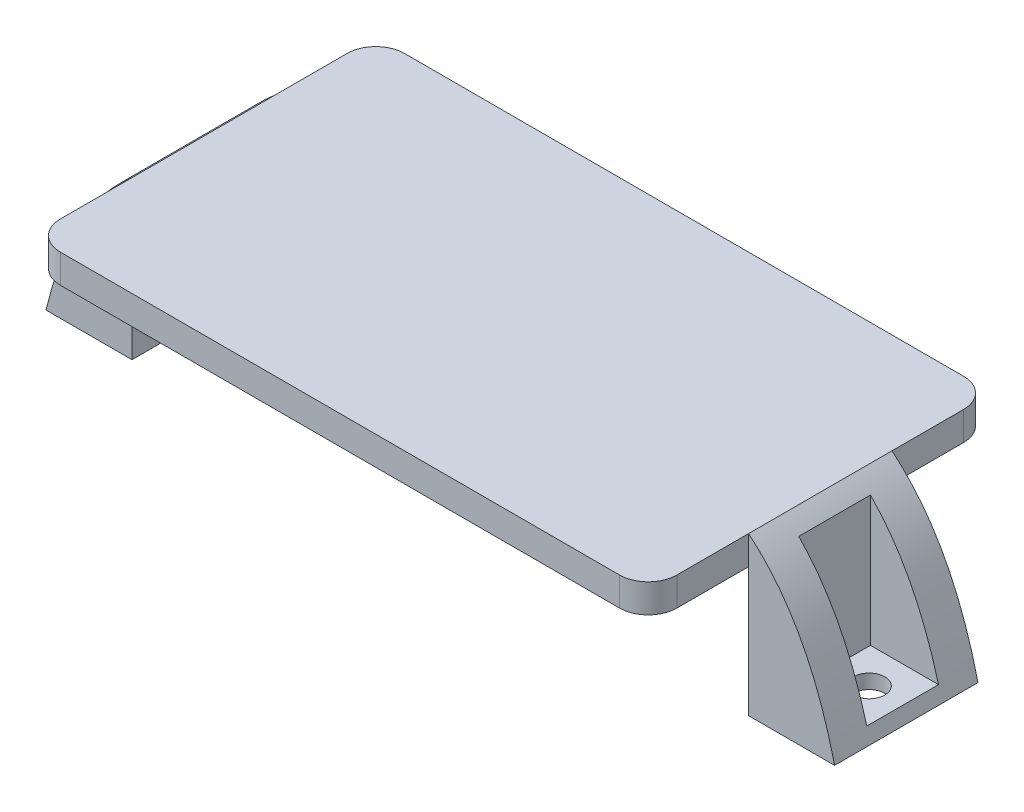
ISO-10303-21;
HEADER;
FILE_DESCRIPTION(('STEP AP214'),'2;1');
FILE_NAME('part.step','',(''),(''),'','','');
FILE_SCHEMA(('AUTOMOTIVE_DESIGN { 1 0 10303 214 1 1 1 1 }'));
ENDSEC;
DATA;
#1=APPLICATION_CONTEXT('core data for automotive mechanical design processes');
#2=APPLICATION_PROTOCOL_DEFINITION('international standard','automotive_design',2000,#1);
#3=PRODUCT_CONTEXT('',#1,'mechanical');
#4=PRODUCT('Part','Part','',(#3));
#5=PRODUCT_RELATED_PRODUCT_CATEGORY('part','',(#4));
#6=PRODUCT_DEFINITION_FORMATION('','',#4);
#7=PRODUCT_DEFINITION_CONTEXT('part definition',#1,'design');
#8=PRODUCT_DEFINITION('design','',#6,#7);
#9=PRODUCT_DEFINITION_SHAPE('','',#8);
#10=(LENGTH_UNIT() NAMED_UNIT(*) SI_UNIT(.MILLI.,.METRE.));
#11=(NAMED_UNIT(*) PLANE_ANGLE_UNIT() SI_UNIT($,.RADIAN.));
#12=(NAMED_UNIT(*) SI_UNIT($,.STERADIAN.) SOLID_ANGLE_UNIT());
#13=UNCERTAINTY_MEASURE_WITH_UNIT(LENGTH_MEASURE(1.E-05),#10,'distance_accuracy_value','');
#14=(GEOMETRIC_REPRESENTATION_CONTEXT(3) GLOBAL_UNCERTAINTY_ASSIGNED_CONTEXT((#13)) GLOBAL_UNIT_ASSIGNED_CONTEXT((#10,
#11,#12)) REPRESENTATION_CONTEXT('',''));
#15=CARTESIAN_POINT('',(0.,0.,0.));
#16=DIRECTION('',(0.,0.,1.));
#17=DIRECTION('',(1.,0.,0.));
#18=AXIS2_PLACEMENT_3D('',#15,#16,#17);
#19=CARTESIAN_POINT('',(-34.925,-13.97,-6.35));
#20=CARTESIAN_POINT('',(-28.7239984805834,11.9854693092136,-6.35));
#21=CARTESIAN_POINT('',(0.,0.,-6.35));
#22=B_SPLINE_CURVE_WITH_KNOTS('',2,(#19,#20,#21),.UNSPECIFIED.,.F.,.F.,(3,3),(0.,1.),.UNSPECIFIED.);
#23=DIRECTION('',(0.,0.,1.));
#24=VECTOR('',#23,1.);
#25=SURFACE_OF_LINEAR_EXTRUSION('',#22,#24);
#26=DIRECTION('',(0.,0.,1.));
#27=VECTOR('',#26,1.);
#28=CARTESIAN_POINT('',(-34.925,-13.97,-6.35));
#29=LINE('',#28,#27);
#30=CARTESIAN_POINT('',(-34.925,-13.97,-6.35));
#31=VERTEX_POINT('',#30);
#32=CARTESIAN_POINT('',(-34.925,-13.97,6.35));
#33=VERTEX_POINT('',#32);
#34=EDGE_CURVE('E243',#31,#33,#29,.T.);
#35=ORIENTED_EDGE('',*,*,#34,.T.);
#36=CARTESIAN_POINT('',(-34.925,-13.97,6.35));
#37=CARTESIAN_POINT('',(-28.7239984805834,11.9854693092136,6.35));
#38=CARTESIAN_POINT('',(0.,0.,6.35));
#39=B_SPLINE_CURVE_WITH_KNOTS('',2,(#36,#37,#38),.UNSPECIFIED.,.F.,.F.,(3,3),(0.,1.),.UNSPECIFIED.);
#40=CARTESIAN_POINT('',(-27.305,0.,6.35));
#41=VERTEX_POINT('',#40);
#42=EDGE_CURVE('E221',#33,#41,#39,.T.);
#43=ORIENTED_EDGE('',*,*,#42,.T.);
#44=DIRECTION('',(0.,0.,1.));
#45=VECTOR('',#44,1.);
#46=CARTESIAN_POINT('',(-27.305,0.,-6.35));
#47=LINE('',#46,#45);
#48=CARTESIAN_POINT('',(-27.305,0.,-6.34999999999999));
#49=VERTEX_POINT('',#48);
#50=EDGE_CURVE('E467',#49,#41,#47,.T.);
#51=ORIENTED_EDGE('',*,*,#50,.F.);
#52=EDGE_CURVE('E236',#31,#49,#22,.T.);
#53=ORIENTED_EDGE('',*,*,#52,.F.);
#54=EDGE_LOOP('',(#35,#43,#51,#53));
#55=FACE_BOUND('',#54,.T.);
#56=CARTESIAN_POINT('',(-34.925,-13.97,-3.175));
#57=CARTESIAN_POINT('',(-28.7239984805834,11.9854693092136,-3.175));
#58=CARTESIAN_POINT('',(0.,0.,-3.175));
#59=B_SPLINE_CURVE_WITH_KNOTS('',2,(#56,#57,#58),.UNSPECIFIED.,.F.,.F.,(3,3),(0.,1.),.UNSPECIFIED.);
#60=CARTESIAN_POINT('',(-28.575,-1.16685256923188,-3.175));
#61=VERTEX_POINT('',#60);
#62=CARTESIAN_POINT('',(-34.6019711182352,-12.7,-3.175));
#63=VERTEX_POINT('',#62);
#64=EDGE_CURVE('E11',#61,#63,#59,.F.);
#65=ORIENTED_EDGE('',*,*,#64,.F.);
#66=DIRECTION('',(0.,0.,1.));
#67=VECTOR('',#66,1.);
#68=CARTESIAN_POINT('',(-28.575,-1.16685256923188,-6.35));
#69=LINE('',#68,#67);
#70=CARTESIAN_POINT('',(-28.575,-1.16685256923593,3.175));
#71=VERTEX_POINT('',#70);
#72=EDGE_CURVE('E50',#71,#61,#69,.F.);
#73=ORIENTED_EDGE('',*,*,#72,.F.);
#74=CARTESIAN_POINT('',(-34.925,-13.97,3.175));
#75=CARTESIAN_POINT('',(-28.7239984805834,11.9854693092136,3.175));
#76=CARTESIAN_POINT('',(0.,0.,3.175));
#77=B_SPLINE_CURVE_WITH_KNOTS('',2,(#74,#75,#76),.UNSPECIFIED.,.F.,.F.,(3,3),(0.,1.),.UNSPECIFIED.);
#78=CARTESIAN_POINT('',(-34.6019711182352,-12.7,3.175));
#79=VERTEX_POINT('',#78);
#80=EDGE_CURVE('E204',#79,#71,#77,.T.);
#81=ORIENTED_EDGE('',*,*,#80,.F.);
#82=DIRECTION('',(0.,0.,1.));
#83=VECTOR('',#82,1.);
#84=CARTESIAN_POINT('',(-34.6019711182352,-12.7,-6.35));
#85=LINE('',#84,#83);
#86=EDGE_CURVE('E208',#63,#79,#85,.T.);
#87=ORIENTED_EDGE('',*,*,#86,.F.);
#88=EDGE_LOOP('',(#65,#73,#81,#87));
#89=FACE_BOUND('',#88,.T.);
#90=ADVANCED_FACE('F41',(#55,#89),#25,.F.);
#91=CARTESIAN_POINT('',(-27.305,-2.54,15.24));
#92=DIRECTION('',(-1.,0.,0.));
#93=DIRECTION('',(0.,0.,1.));
#94=AXIS2_PLACEMENT_3D('',#91,#92,#93);
#95=PLANE('',#94);
#96=DIRECTION('',(0.,0.,1.));
#97=VECTOR('',#96,1.);
#98=CARTESIAN_POINT('',(-27.305,0.,15.24));
#99=LINE('',#98,#97);
#100=CARTESIAN_POINT('',(-27.305,0.,12.7));
#101=VERTEX_POINT('',#100);
#102=EDGE_CURVE('E348',#41,#101,#99,.T.);
#103=ORIENTED_EDGE('',*,*,#102,.F.);
#104=DIRECTION('',(0.,-1.,0.));
#105=VECTOR('',#104,1.);
#106=CARTESIAN_POINT('',(-27.305,0.,6.35));
#107=LINE('',#106,#105);
#108=CARTESIAN_POINT('',(-27.305,-2.54,6.35));
#109=VERTEX_POINT('',#108);
#110=EDGE_CURVE('E64',#41,#109,#107,.T.);
#111=ORIENTED_EDGE('',*,*,#110,.T.);
#112=DIRECTION('',(0.,0.,1.));
#113=VECTOR('',#112,1.);
#114=CARTESIAN_POINT('',(-27.305,-2.54,15.24));
#115=LINE('',#114,#113);
#116=CARTESIAN_POINT('',(-27.305,-2.54,12.7));
#117=VERTEX_POINT('',#116);
#118=EDGE_CURVE('E334',#109,#117,#115,.T.);
#119=ORIENTED_EDGE('',*,*,#118,.T.);
#120=DIRECTION('',(0.,1.,0.));
#121=VECTOR('',#120,1.);
#122=CARTESIAN_POINT('',(-27.305,-2.54,12.7));
#123=LINE('',#122,#121);
#124=EDGE_CURVE('E367',#117,#101,#123,.T.);
#125=ORIENTED_EDGE('',*,*,#124,.T.);
#126=EDGE_LOOP('',(#103,#111,#119,#125));
#127=FACE_BOUND('',#126,.T.);
#128=ADVANCED_FACE('F252',(#127),#95,.T.);
#129=CARTESIAN_POINT('',(27.305,-2.54,15.24));
#130=DIRECTION('',(1.,0.,0.));
#131=DIRECTION('',(0.,0.,-1.));
#132=AXIS2_PLACEMENT_3D('',#129,#130,#131);
#133=PLANE('',#132);
#134=DIRECTION('',(0.,0.,-1.));
#135=VECTOR('',#134,1.);
#136=CARTESIAN_POINT('',(27.305,0.,15.24));
#137=LINE('',#136,#135);
#138=CARTESIAN_POINT('',(27.305,0.,-6.35));
#139=VERTEX_POINT('',#138);
#140=CARTESIAN_POINT('',(27.305,0.,-12.7));
#141=VERTEX_POINT('',#140);
#142=EDGE_CURVE('E322',#139,#141,#137,.T.);
#143=ORIENTED_EDGE('',*,*,#142,.F.);
#144=DIRECTION('',(0.,-1.,0.));
#145=VECTOR('',#144,1.);
#146=CARTESIAN_POINT('',(27.305,0.,-6.35));
#147=LINE('',#146,#145);
#148=CARTESIAN_POINT('',(27.305,-2.54,-6.34999999999999));
#149=VERTEX_POINT('',#148);
#150=EDGE_CURVE('E312',#139,#149,#147,.T.);
#151=ORIENTED_EDGE('',*,*,#150,.T.);
#152=DIRECTION('',(0.,0.,-1.));
#153=VECTOR('',#152,1.);
#154=CARTESIAN_POINT('',(27.305,-2.54,15.24));
#155=LINE('',#154,#153);
#156=CARTESIAN_POINT('',(27.305,-2.54,-12.7));
#157=VERTEX_POINT('',#156);
#158=EDGE_CURVE('E331',#149,#157,#155,.T.);
#159=ORIENTED_EDGE('',*,*,#158,.T.);
#160=DIRECTION('',(0.,1.,0.));
#161=VECTOR('',#160,1.);
#162=CARTESIAN_POINT('',(27.305,-2.54,-12.7));
#163=LINE('',#162,#161);
#164=EDGE_CURVE('E387',#157,#141,#163,.T.);
#165=ORIENTED_EDGE('',*,*,#164,.T.);
#166=EDGE_LOOP('',(#143,#151,#159,#165));
#167=FACE_BOUND('',#166,.T.);
#168=ADVANCED_FACE('F556',(#167),#133,.T.);
#169=DIRECTION('',(0.,-1.,0.));
#170=VECTOR('',#169,1.);
#171=CARTESIAN_POINT('',(27.305,0.,6.35));
#172=LINE('',#171,#170);
#173=CARTESIAN_POINT('',(27.305,0.,6.35));
#174=VERTEX_POINT('',#173);
#175=CARTESIAN_POINT('',(27.305,-2.54,6.35));
#176=VERTEX_POINT('',#175);
#177=EDGE_CURVE('E496',#174,#176,#172,.T.);
#178=ORIENTED_EDGE('',*,*,#177,.F.);
#179=CARTESIAN_POINT('',(27.305,0.,12.7));
#180=VERTEX_POINT('',#179);
#181=EDGE_CURVE('E342',#180,#174,#137,.T.);
#182=ORIENTED_EDGE('',*,*,#181,.F.);
#183=DIRECTION('',(0.,1.,0.));
#184=VECTOR('',#183,1.);
#185=CARTESIAN_POINT('',(27.305,-2.54,12.7));
#186=LINE('',#185,#184);
#187=CARTESIAN_POINT('',(27.305,-2.54,12.7));
#188=VERTEX_POINT('',#187);
#189=EDGE_CURVE('E390',#180,#188,#186,.F.);
#190=ORIENTED_EDGE('',*,*,#189,.T.);
#191=EDGE_CURVE('E326',#188,#176,#155,.T.);
#192=ORIENTED_EDGE('',*,*,#191,.T.);
#193=EDGE_LOOP('',(#178,#182,#190,#192));
#194=FACE_BOUND('',#193,.T.);
#195=ADVANCED_FACE('F515',(#194),#133,.T.);
#196=CARTESIAN_POINT('',(-27.305,-2.54,15.24));
#197=DIRECTION('',(0.,0.,1.));
#198=DIRECTION('',(1.,0.,0.));
#199=AXIS2_PLACEMENT_3D('',#196,#197,#198);
#200=PLANE('',#199);
#201=DIRECTION('',(1.,0.,0.));
#202=VECTOR('',#201,1.);
#203=CARTESIAN_POINT('',(-27.305,0.,15.24));
#204=LINE('',#203,#202);
#205=CARTESIAN_POINT('',(-24.765,0.,15.24));
#206=VERTEX_POINT('',#205);
#207=CARTESIAN_POINT('',(24.765,0.,15.24));
#208=VERTEX_POINT('',#207);
#209=EDGE_CURVE('E352',#206,#208,#204,.T.);
#210=ORIENTED_EDGE('',*,*,#209,.F.);
#211=DIRECTION('',(0.,1.,0.));
#212=VECTOR('',#211,1.);
#213=CARTESIAN_POINT('',(-24.765,-2.54,15.24));
#214=LINE('',#213,#212);
#215=CARTESIAN_POINT('',(-24.765,-2.54,15.24));
#216=VERTEX_POINT('',#215);
#217=EDGE_CURVE('E385',#206,#216,#214,.F.);
#218=ORIENTED_EDGE('',*,*,#217,.T.);
#219=DIRECTION('',(1.,0.,0.));
#220=VECTOR('',#219,1.);
#221=CARTESIAN_POINT('',(-27.305,-2.54,15.24));
#222=LINE('',#221,#220);
#223=CARTESIAN_POINT('',(24.765,-2.54,15.24));
#224=VERTEX_POINT('',#223);
#225=EDGE_CURVE('E337',#216,#224,#222,.T.);
#226=ORIENTED_EDGE('',*,*,#225,.T.);
#227=DIRECTION('',(0.,1.,0.));
#228=VECTOR('',#227,1.);
#229=CARTESIAN_POINT('',(24.765,-2.54,15.24));
#230=LINE('',#229,#228);
#231=EDGE_CURVE('E382',#224,#208,#230,.T.);
#232=ORIENTED_EDGE('',*,*,#231,.T.);
#233=EDGE_LOOP('',(#210,#218,#226,#232));
#234=FACE_BOUND('',#233,.T.);
#235=ADVANCED_FACE('F525',(#234),#200,.T.);
#236=DIRECTION('',(0.,-1.,0.));
#237=VECTOR('',#236,1.);
#238=CARTESIAN_POINT('',(-27.305,0.,-6.35));
#239=LINE('',#238,#237);
#240=CARTESIAN_POINT('',(-27.305,-2.54,-6.35));
#241=VERTEX_POINT('',#240);
#242=EDGE_CURVE('E233',#49,#241,#239,.T.);
#243=ORIENTED_EDGE('',*,*,#242,.F.);
#244=CARTESIAN_POINT('',(-27.305,0.,-12.7));
#245=VERTEX_POINT('',#244);
#246=EDGE_CURVE('E349',#245,#49,#99,.T.);
#247=ORIENTED_EDGE('',*,*,#246,.F.);
#248=DIRECTION('',(0.,1.,0.));
#249=VECTOR('',#248,1.);
#250=CARTESIAN_POINT('',(-27.305,-2.54,-12.7));
#251=LINE('',#250,#249);
#252=CARTESIAN_POINT('',(-27.305,-2.54,-12.7));
#253=VERTEX_POINT('',#252);
#254=EDGE_CURVE('E370',#245,#253,#251,.F.);
#255=ORIENTED_EDGE('',*,*,#254,.T.);
#256=EDGE_CURVE('E335',#253,#241,#115,.T.);
#257=ORIENTED_EDGE('',*,*,#256,.T.);
#258=EDGE_LOOP('',(#243,#247,#255,#257));
#259=FACE_BOUND('',#258,.T.);
#260=ADVANCED_FACE('F567',(#259),#95,.T.);
#261=CARTESIAN_POINT('',(-27.305,-2.54,-15.24));
#262=DIRECTION('',(0.,0.,-1.));
#263=DIRECTION('',(-1.,0.,0.));
#264=AXIS2_PLACEMENT_3D('',#261,#262,#263);
#265=PLANE('',#264);
#266=DIRECTION('',(-1.,0.,0.));
#267=VECTOR('',#266,1.);
#268=CARTESIAN_POINT('',(-27.305,-2.54,-15.24));
#269=LINE('',#268,#267);
#270=CARTESIAN_POINT('',(24.765,-2.54,-15.24));
#271=VERTEX_POINT('',#270);
#272=CARTESIAN_POINT('',(-24.765,-2.54,-15.24));
#273=VERTEX_POINT('',#272);
#274=EDGE_CURVE('E329',#271,#273,#269,.T.);
#275=ORIENTED_EDGE('',*,*,#274,.T.);
#276=DIRECTION('',(0.,1.,0.));
#277=VECTOR('',#276,1.);
#278=CARTESIAN_POINT('',(-24.765,-2.54,-15.24));
#279=LINE('',#278,#277);
#280=CARTESIAN_POINT('',(-24.765,0.,-15.24));
#281=VERTEX_POINT('',#280);
#282=EDGE_CURVE('E356',#273,#281,#279,.T.);
#283=ORIENTED_EDGE('',*,*,#282,.T.);
#284=DIRECTION('',(-1.,0.,0.));
#285=VECTOR('',#284,1.);
#286=CARTESIAN_POINT('',(-27.305,0.,-15.24));
#287=LINE('',#286,#285);
#288=CARTESIAN_POINT('',(24.765,0.,-15.24));
#289=VERTEX_POINT('',#288);
#290=EDGE_CURVE('E345',#289,#281,#287,.T.);
#291=ORIENTED_EDGE('',*,*,#290,.F.);
#292=DIRECTION('',(0.,1.,0.));
#293=VECTOR('',#292,1.);
#294=CARTESIAN_POINT('',(24.765,-2.54,-15.24));
#295=LINE('',#294,#293);
#296=EDGE_CURVE('E341',#289,#271,#295,.F.);
#297=ORIENTED_EDGE('',*,*,#296,.T.);
#298=EDGE_LOOP('',(#275,#283,#291,#297));
#299=FACE_BOUND('',#298,.T.);
#300=ADVANCED_FACE('F547',(#299),#265,.T.);
#301=CARTESIAN_POINT('',(0.,-2.54,0.));
#302=DIRECTION('',(0.,-1.,0.));
#303=DIRECTION('',(0.,0.,-1.));
#304=AXIS2_PLACEMENT_3D('',#301,#302,#303);
#305=PLANE('',#304);
#306=ORIENTED_EDGE('',*,*,#256,.F.);
#307=CARTESIAN_POINT('',(-24.765,-2.54,-12.7));
#308=DIRECTION('',(0.,-1.,0.));
#309=DIRECTION('',(0.,0.,-1.));
#310=AXIS2_PLACEMENT_3D('',#307,#308,#309);
#311=CIRCLE('',#310,2.54);
#312=EDGE_CURVE('E380',#253,#273,#311,.T.);
#313=ORIENTED_EDGE('',*,*,#312,.T.);
#314=ORIENTED_EDGE('',*,*,#274,.F.);
#315=CARTESIAN_POINT('',(24.765,-2.54,-12.7));
#316=DIRECTION('',(0.,-1.,0.));
#317=DIRECTION('',(0.,0.,-1.));
#318=AXIS2_PLACEMENT_3D('',#315,#316,#317);
#319=CIRCLE('',#318,2.54);
#320=EDGE_CURVE('E372',#271,#157,#319,.T.);
#321=ORIENTED_EDGE('',*,*,#320,.T.);
#322=ORIENTED_EDGE('',*,*,#158,.F.);
#323=EDGE_CURVE('E330',#176,#149,#155,.T.);
#324=ORIENTED_EDGE('',*,*,#323,.F.);
#325=ORIENTED_EDGE('',*,*,#191,.F.);
#326=CARTESIAN_POINT('',(24.765,-2.54,12.7));
#327=DIRECTION('',(0.,-1.,0.));
#328=DIRECTION('',(0.,0.,-1.));
#329=AXIS2_PLACEMENT_3D('',#326,#327,#328);
#330=CIRCLE('',#329,2.54);
#331=EDGE_CURVE('E375',#188,#224,#330,.T.);
#332=ORIENTED_EDGE('',*,*,#331,.T.);
#333=ORIENTED_EDGE('',*,*,#225,.F.);
#334=CARTESIAN_POINT('',(-24.765,-2.54,12.7));
#335=DIRECTION('',(0.,-1.,0.));
#336=DIRECTION('',(0.,0.,-1.));
#337=AXIS2_PLACEMENT_3D('',#334,#335,#336);
#338=CIRCLE('',#337,2.54);
#339=EDGE_CURVE('E377',#216,#117,#338,.T.);
#340=ORIENTED_EDGE('',*,*,#339,.T.);
#341=ORIENTED_EDGE('',*,*,#118,.F.);
#342=EDGE_CURVE('E338',#241,#109,#115,.T.);
#343=ORIENTED_EDGE('',*,*,#342,.F.);
#344=EDGE_LOOP('',(#306,#313,#314,#321,#322,#324,#325,#332,#333,#340,#341,#343));
#345=FACE_BOUND('',#344,.T.);
#346=ADVANCED_FACE('F531',(#345),#305,.T.);
#347=CARTESIAN_POINT('',(0.,0.,0.));
#348=DIRECTION('',(0.,-1.,0.));
#349=DIRECTION('',(0.,0.,-1.));
#350=AXIS2_PLACEMENT_3D('',#347,#348,#349);
#351=PLANE('',#350);
#352=ORIENTED_EDGE('',*,*,#290,.T.);
#353=CARTESIAN_POINT('',(-24.765,0.,-12.7));
#354=DIRECTION('',(0.,-1.,0.));
#355=DIRECTION('',(0.,0.,-1.));
#356=AXIS2_PLACEMENT_3D('',#353,#354,#355);
#357=CIRCLE('',#356,2.54);
#358=EDGE_CURVE('E365',#281,#245,#357,.F.);
#359=ORIENTED_EDGE('',*,*,#358,.T.);
#360=ORIENTED_EDGE('',*,*,#246,.T.);
#361=ORIENTED_EDGE('',*,*,#50,.T.);
#362=ORIENTED_EDGE('',*,*,#102,.T.);
#363=CARTESIAN_POINT('',(-24.765,0.,12.7));
#364=DIRECTION('',(0.,-1.,0.));
#365=DIRECTION('',(0.,0.,-1.));
#366=AXIS2_PLACEMENT_3D('',#363,#364,#365);
#367=CIRCLE('',#366,2.54);
#368=EDGE_CURVE('E363',#101,#206,#367,.F.);
#369=ORIENTED_EDGE('',*,*,#368,.T.);
#370=ORIENTED_EDGE('',*,*,#209,.T.);
#371=CARTESIAN_POINT('',(24.765,0.,12.7));
#372=DIRECTION('',(0.,-1.,0.));
#373=DIRECTION('',(0.,0.,-1.));
#374=AXIS2_PLACEMENT_3D('',#371,#372,#373);
#375=CIRCLE('',#374,2.54);
#376=EDGE_CURVE('E361',#208,#180,#375,.F.);
#377=ORIENTED_EDGE('',*,*,#376,.T.);
#378=ORIENTED_EDGE('',*,*,#181,.T.);
#379=DIRECTION('',(0.,0.,1.));
#380=VECTOR('',#379,1.);
#381=CARTESIAN_POINT('',(27.305,0.,-6.35));
#382=LINE('',#381,#380);
#383=EDGE_CURVE('E323',#139,#174,#382,.T.);
#384=ORIENTED_EDGE('',*,*,#383,.F.);
#385=ORIENTED_EDGE('',*,*,#142,.T.);
#386=CARTESIAN_POINT('',(24.765,0.,-12.7));
#387=DIRECTION('',(0.,-1.,0.));
#388=DIRECTION('',(0.,0.,-1.));
#389=AXIS2_PLACEMENT_3D('',#386,#387,#388);
#390=CIRCLE('',#389,2.54);
#391=EDGE_CURVE('E359',#141,#289,#390,.F.);
#392=ORIENTED_EDGE('',*,*,#391,.T.);
#393=EDGE_LOOP('',(#352,#359,#360,#361,#362,#369,#370,#377,#378,#384,#385,#392));
#394=FACE_BOUND('',#393,.T.);
#395=ADVANCED_FACE('F518',(#394),#351,.F.);
#396=CARTESIAN_POINT('',(-24.765,-2.54,-12.7));
#397=DIRECTION('',(0.,1.,0.));
#398=DIRECTION('',(0.,0.,1.));
#399=AXIS2_PLACEMENT_3D('',#396,#397,#398);
#400=CYLINDRICAL_SURFACE('',#399,2.54);
#401=ORIENTED_EDGE('',*,*,#312,.F.);
#402=ORIENTED_EDGE('',*,*,#254,.F.);
#403=ORIENTED_EDGE('',*,*,#358,.F.);
#404=ORIENTED_EDGE('',*,*,#282,.F.);
#405=EDGE_LOOP('',(#401,#402,#403,#404));
#406=FACE_BOUND('',#405,.T.);
#407=ADVANCED_FACE('F544',(#406),#400,.T.);
#408=CARTESIAN_POINT('',(-24.765,-2.54,12.7));
#409=DIRECTION('',(0.,1.,0.));
#410=DIRECTION('',(0.,0.,1.));
#411=AXIS2_PLACEMENT_3D('',#408,#409,#410);
#412=CYLINDRICAL_SURFACE('',#411,2.54);
#413=ORIENTED_EDGE('',*,*,#339,.F.);
#414=ORIENTED_EDGE('',*,*,#217,.F.);
#415=ORIENTED_EDGE('',*,*,#368,.F.);
#416=ORIENTED_EDGE('',*,*,#124,.F.);
#417=EDGE_LOOP('',(#413,#414,#415,#416));
#418=FACE_BOUND('',#417,.T.);
#419=ADVANCED_FACE('F534',(#418),#412,.T.);
#420=CARTESIAN_POINT('',(24.765,-2.54,12.7));
#421=DIRECTION('',(0.,1.,0.));
#422=DIRECTION('',(0.,0.,1.));
#423=AXIS2_PLACEMENT_3D('',#420,#421,#422);
#424=CYLINDRICAL_SURFACE('',#423,2.54);
#425=ORIENTED_EDGE('',*,*,#331,.F.);
#426=ORIENTED_EDGE('',*,*,#189,.F.);
#427=ORIENTED_EDGE('',*,*,#376,.F.);
#428=ORIENTED_EDGE('',*,*,#231,.F.);
#429=EDGE_LOOP('',(#425,#426,#427,#428));
#430=FACE_BOUND('',#429,.T.);
#431=ADVANCED_FACE('F523',(#430),#424,.T.);
#432=CARTESIAN_POINT('',(24.765,-2.54,-12.7));
#433=DIRECTION('',(0.,1.,0.));
#434=DIRECTION('',(0.,0.,1.));
#435=AXIS2_PLACEMENT_3D('',#432,#433,#434);
#436=CYLINDRICAL_SURFACE('',#435,2.54);
#437=ORIENTED_EDGE('',*,*,#320,.F.);
#438=ORIENTED_EDGE('',*,*,#296,.F.);
#439=ORIENTED_EDGE('',*,*,#391,.F.);
#440=ORIENTED_EDGE('',*,*,#164,.F.);
#441=EDGE_LOOP('',(#437,#438,#439,#440));
#442=FACE_BOUND('',#441,.T.);
#443=ADVANCED_FACE('F43',(#442),#436,.T.);
#444=CARTESIAN_POINT('',(0.,-13.97,-6.35));
#445=DIRECTION('',(0.,-1.,0.));
#446=DIRECTION('',(0.,0.,-1.));
#447=AXIS2_PLACEMENT_3D('',#444,#445,#446);
#448=PLANE('',#447);
#449=CARTESIAN_POINT('',(31.623,-13.97,0.));
#450=DIRECTION('',(0.,-1.,0.));
#451=DIRECTION('',(0.,0.,-1.));
#452=AXIS2_PLACEMENT_3D('',#449,#450,#451);
#453=CIRCLE('',#452,1.39700000000001);
#454=CARTESIAN_POINT('',(31.623,-13.97,-1.39700000000001));
#455=VERTEX_POINT('',#454);
#456=EDGE_CURVE('E416',#455,#455,#453,.T.);
#457=ORIENTED_EDGE('',*,*,#456,.F.);
#458=EDGE_LOOP('',(#457));
#459=FACE_BOUND('',#458,.T.);
#460=DIRECTION('',(0.,0.,1.));
#461=VECTOR('',#460,1.);
#462=CARTESIAN_POINT('',(34.925,-13.97,-6.35));
#463=LINE('',#462,#461);
#464=CARTESIAN_POINT('',(34.925,-13.97,-6.35));
#465=VERTEX_POINT('',#464);
#466=CARTESIAN_POINT('',(34.925,-13.97,6.35));
#467=VERTEX_POINT('',#466);
#468=EDGE_CURVE('E318',#465,#467,#463,.T.);
#469=ORIENTED_EDGE('',*,*,#468,.T.);
#470=DIRECTION('',(1.,0.,0.));
#471=VECTOR('',#470,1.);
#472=CARTESIAN_POINT('',(0.,-13.97,6.35));
#473=LINE('',#472,#471);
#474=CARTESIAN_POINT('',(27.305,-13.97,6.35));
#475=VERTEX_POINT('',#474);
#476=EDGE_CURVE('E486',#475,#467,#473,.T.);
#477=ORIENTED_EDGE('',*,*,#476,.F.);
#478=DIRECTION('',(0.,0.,1.));
#479=VECTOR('',#478,1.);
#480=CARTESIAN_POINT('',(27.305,-13.97,-6.35));
#481=LINE('',#480,#479);
#482=CARTESIAN_POINT('',(27.305,-13.97,-6.35));
#483=VERTEX_POINT('',#482);
#484=EDGE_CURVE('E319',#483,#475,#481,.T.);
#485=ORIENTED_EDGE('',*,*,#484,.F.);
#486=DIRECTION('',(1.,0.,0.));
#487=VECTOR('',#486,1.);
#488=CARTESIAN_POINT('',(0.,-13.97,-6.35));
#489=LINE('',#488,#487);
#490=EDGE_CURVE('E310',#483,#465,#489,.T.);
#491=ORIENTED_EDGE('',*,*,#490,.T.);
#492=EDGE_LOOP('',(#469,#477,#485,#491));
#493=FACE_BOUND('',#492,.T.);
#494=ADVANCED_FACE('F296',(#459,#493),#448,.T.);
#495=CARTESIAN_POINT('',(27.305,0.,-6.35));
#496=DIRECTION('',(-1.,0.,0.));
#497=DIRECTION('',(0.,0.,1.));
#498=AXIS2_PLACEMENT_3D('',#495,#496,#497);
#499=PLANE('',#498);
#500=EDGE_CURVE('E495',#176,#475,#172,.T.);
#501=ORIENTED_EDGE('',*,*,#500,.F.);
#502=ORIENTED_EDGE('',*,*,#323,.T.);
#503=EDGE_CURVE('E309',#149,#483,#147,.T.);
#504=ORIENTED_EDGE('',*,*,#503,.T.);
#505=ORIENTED_EDGE('',*,*,#484,.T.);
#506=EDGE_LOOP('',(#501,#502,#504,#505));
#507=FACE_BOUND('',#506,.T.);
#508=ADVANCED_FACE('F293',(#507),#499,.T.);
#509=CARTESIAN_POINT('',(34.925,-13.97,-6.35));
#510=CARTESIAN_POINT('',(28.7239984805834,11.9854693092136,-6.35));
#511=CARTESIAN_POINT('',(0.,0.,-6.35));
#512=B_SPLINE_CURVE_WITH_KNOTS('',2,(#509,#510,#511),.UNSPECIFIED.,.F.,.F.,(3,3),(0.,1.),.UNSPECIFIED.);
#513=DIRECTION('',(0.,0.,1.));
#514=VECTOR('',#513,1.);
#515=SURFACE_OF_LINEAR_EXTRUSION('',#512,#514);
#516=CARTESIAN_POINT('',(34.925,-13.97,3.175));
#517=CARTESIAN_POINT('',(28.7239984805834,11.9854693092136,3.175));
#518=CARTESIAN_POINT('',(0.,0.,3.175));
#519=B_SPLINE_CURVE_WITH_KNOTS('',2,(#516,#517,#518),.UNSPECIFIED.,.F.,.F.,(3,3),(0.,1.),.UNSPECIFIED.);
#520=CARTESIAN_POINT('',(28.575,-1.16685256923188,3.175));
#521=VERTEX_POINT('',#520);
#522=CARTESIAN_POINT('',(34.6019711182352,-12.7,3.175));
#523=VERTEX_POINT('',#522);
#524=EDGE_CURVE('E404',#521,#523,#519,.F.);
#525=ORIENTED_EDGE('',*,*,#524,.F.);
#526=DIRECTION('',(0.,0.,1.));
#527=VECTOR('',#526,1.);
#528=CARTESIAN_POINT('',(28.575,-1.16685256923188,-6.35));
#529=LINE('',#528,#527);
#530=CARTESIAN_POINT('',(28.575,-1.16685256923593,-3.175));
#531=VERTEX_POINT('',#530);
#532=EDGE_CURVE('E399',#531,#521,#529,.T.);
#533=ORIENTED_EDGE('',*,*,#532,.F.);
#534=CARTESIAN_POINT('',(34.925,-13.97,-3.175));
#535=CARTESIAN_POINT('',(28.7239984805834,11.9854693092136,-3.175));
#536=CARTESIAN_POINT('',(0.,0.,-3.175));
#537=B_SPLINE_CURVE_WITH_KNOTS('',2,(#534,#535,#536),.UNSPECIFIED.,.F.,.F.,(3,3),(0.,1.),.UNSPECIFIED.);
#538=CARTESIAN_POINT('',(34.6019711182352,-12.7,-3.175));
#539=VERTEX_POINT('',#538);
#540=EDGE_CURVE('E395',#539,#531,#537,.T.);
#541=ORIENTED_EDGE('',*,*,#540,.F.);
#542=DIRECTION('',(0.,0.,1.));
#543=VECTOR('',#542,1.);
#544=CARTESIAN_POINT('',(34.6019711182352,-12.7,-6.35));
#545=LINE('',#544,#543);
#546=EDGE_CURVE('E392',#539,#523,#545,.T.);
#547=ORIENTED_EDGE('',*,*,#546,.T.);
#548=EDGE_LOOP('',(#525,#533,#541,#547));
#549=FACE_BOUND('',#548,.T.);
#550=ORIENTED_EDGE('',*,*,#383,.T.);
#551=CARTESIAN_POINT('',(34.925,-13.97,6.35));
#552=CARTESIAN_POINT('',(28.7239984805834,11.9854693092136,6.35));
#553=CARTESIAN_POINT('',(0.,0.,6.35));
#554=B_SPLINE_CURVE_WITH_KNOTS('',2,(#551,#552,#553),.UNSPECIFIED.,.F.,.F.,(3,3),(0.,1.),.UNSPECIFIED.);
#555=EDGE_CURVE('E491',#467,#174,#554,.T.);
#556=ORIENTED_EDGE('',*,*,#555,.F.);
#557=ORIENTED_EDGE('',*,*,#468,.F.);
#558=EDGE_CURVE('E303',#465,#139,#512,.T.);
#559=ORIENTED_EDGE('',*,*,#558,.T.);
#560=EDGE_LOOP('',(#550,#556,#557,#559));
#561=FACE_BOUND('',#560,.T.);
#562=ADVANCED_FACE('F291',(#549,#561),#515,.T.);
#563=CARTESIAN_POINT('',(0.,0.,-6.35));
#564=DIRECTION('',(0.,0.,1.));
#565=DIRECTION('',(1.,0.,0.));
#566=AXIS2_PLACEMENT_3D('',#563,#564,#565);
#567=PLANE('',#566);
#568=ORIENTED_EDGE('',*,*,#490,.F.);
#569=ORIENTED_EDGE('',*,*,#503,.F.);
#570=ORIENTED_EDGE('',*,*,#150,.F.);
#571=ORIENTED_EDGE('',*,*,#558,.F.);
#572=EDGE_LOOP('',(#568,#569,#570,#571));
#573=FACE_BOUND('',#572,.T.);
#574=ADVANCED_FACE('F287',(#573),#567,.F.);
#575=CARTESIAN_POINT('',(0.,0.,6.35));
#576=DIRECTION('',(0.,0.,1.));
#577=DIRECTION('',(1.,0.,0.));
#578=AXIS2_PLACEMENT_3D('',#575,#576,#577);
#579=PLANE('',#578);
#580=ORIENTED_EDGE('',*,*,#476,.T.);
#581=ORIENTED_EDGE('',*,*,#555,.T.);
#582=ORIENTED_EDGE('',*,*,#177,.T.);
#583=ORIENTED_EDGE('',*,*,#500,.T.);
#584=EDGE_LOOP('',(#580,#581,#582,#583));
#585=FACE_BOUND('',#584,.T.);
#586=ADVANCED_FACE('F277',(#585),#579,.T.);
#587=CARTESIAN_POINT('',(34.925,-12.7,3.175));
#588=DIRECTION('',(0.,0.,1.));
#589=DIRECTION('',(1.,0.,0.));
#590=AXIS2_PLACEMENT_3D('',#587,#588,#589);
#591=PLANE('',#590);
#592=ORIENTED_EDGE('',*,*,#524,.T.);
#593=DIRECTION('',(1.,0.,0.));
#594=VECTOR('',#593,1.);
#595=CARTESIAN_POINT('',(34.925,-12.7,3.175));
#596=LINE('',#595,#594);
#597=CARTESIAN_POINT('',(28.575,-12.7,3.175));
#598=VERTEX_POINT('',#597);
#599=EDGE_CURVE('E480',#598,#523,#596,.T.);
#600=ORIENTED_EDGE('',*,*,#599,.F.);
#601=DIRECTION('',(0.,1.,0.));
#602=VECTOR('',#601,1.);
#603=CARTESIAN_POINT('',(28.575,-12.7,3.175));
#604=LINE('',#603,#602);
#605=EDGE_CURVE('E483',#598,#521,#604,.T.);
#606=ORIENTED_EDGE('',*,*,#605,.T.);
#607=EDGE_LOOP('',(#592,#600,#606));
#608=FACE_BOUND('',#607,.T.);
#609=ADVANCED_FACE('F273',(#608),#591,.F.);
#610=CARTESIAN_POINT('',(28.575,-12.7,3.175));
#611=DIRECTION('',(-1.,0.,0.));
#612=DIRECTION('',(0.,0.,1.));
#613=AXIS2_PLACEMENT_3D('',#610,#611,#612);
#614=PLANE('',#613);
#615=ORIENTED_EDGE('',*,*,#532,.T.);
#616=ORIENTED_EDGE('',*,*,#605,.F.);
#617=DIRECTION('',(0.,0.,1.));
#618=VECTOR('',#617,1.);
#619=CARTESIAN_POINT('',(28.575,-12.7,3.175));
#620=LINE('',#619,#618);
#621=CARTESIAN_POINT('',(28.575,-12.7,-3.175));
#622=VERTEX_POINT('',#621);
#623=EDGE_CURVE('E477',#622,#598,#620,.T.);
#624=ORIENTED_EDGE('',*,*,#623,.F.);
#625=DIRECTION('',(0.,1.,0.));
#626=VECTOR('',#625,1.);
#627=CARTESIAN_POINT('',(28.575,-12.7,-3.175));
#628=LINE('',#627,#626);
#629=EDGE_CURVE('E482',#622,#531,#628,.T.);
#630=ORIENTED_EDGE('',*,*,#629,.T.);
#631=EDGE_LOOP('',(#615,#616,#624,#630));
#632=FACE_BOUND('',#631,.T.);
#633=ADVANCED_FACE('F276',(#632),#614,.F.);
#634=CARTESIAN_POINT('',(34.925,-12.7,-3.175));
#635=DIRECTION('',(0.,0.,-1.));
#636=DIRECTION('',(-1.,0.,0.));
#637=AXIS2_PLACEMENT_3D('',#634,#635,#636);
#638=PLANE('',#637);
#639=ORIENTED_EDGE('',*,*,#540,.T.);
#640=ORIENTED_EDGE('',*,*,#629,.F.);
#641=DIRECTION('',(-1.,0.,0.));
#642=VECTOR('',#641,1.);
#643=CARTESIAN_POINT('',(34.925,-12.7,-3.175));
#644=LINE('',#643,#642);
#645=EDGE_CURVE('E415',#539,#622,#644,.T.);
#646=ORIENTED_EDGE('',*,*,#645,.F.);
#647=EDGE_LOOP('',(#639,#640,#646));
#648=FACE_BOUND('',#647,.T.);
#649=ADVANCED_FACE('F271',(#648),#638,.F.);
#650=CARTESIAN_POINT('',(0.,-12.7,0.));
#651=DIRECTION('',(0.,1.,0.));
#652=DIRECTION('',(0.,0.,1.));
#653=AXIS2_PLACEMENT_3D('',#650,#651,#652);
#654=PLANE('',#653);
#655=CARTESIAN_POINT('',(31.623,-12.7,0.));
#656=DIRECTION('',(0.,1.,0.));
#657=DIRECTION('',(0.,0.,1.));
#658=AXIS2_PLACEMENT_3D('',#655,#656,#657);
#659=CIRCLE('',#658,1.39700000000001);
#660=CARTESIAN_POINT('',(31.623,-12.7,1.39700000000001));
#661=VERTEX_POINT('',#660);
#662=EDGE_CURVE('E409',#661,#661,#659,.T.);
#663=ORIENTED_EDGE('',*,*,#662,.F.);
#664=EDGE_LOOP('',(#663));
#665=FACE_BOUND('',#664,.T.);
#666=ORIENTED_EDGE('',*,*,#645,.T.);
#667=ORIENTED_EDGE('',*,*,#623,.T.);
#668=ORIENTED_EDGE('',*,*,#599,.T.);
#669=ORIENTED_EDGE('',*,*,#546,.F.);
#670=EDGE_LOOP('',(#666,#667,#668,#669));
#671=FACE_BOUND('',#670,.T.);
#672=ADVANCED_FACE('F267',(#665,#671),#654,.T.);
#673=CARTESIAN_POINT('',(31.623,0.,0.));
#674=DIRECTION('',(0.,-1.,0.));
#675=DIRECTION('',(0.,0.,-1.));
#676=AXIS2_PLACEMENT_3D('',#673,#674,#675);
#677=CYLINDRICAL_SURFACE('',#676,1.39700000000001);
#678=ORIENTED_EDGE('',*,*,#662,.T.);
#679=EDGE_LOOP('',(#678));
#680=FACE_BOUND('',#679,.T.);
#681=ORIENTED_EDGE('',*,*,#456,.T.);
#682=EDGE_LOOP('',(#681));
#683=FACE_BOUND('',#682,.T.);
#684=ADVANCED_FACE('F260',(#680,#683),#677,.F.);
#685=CARTESIAN_POINT('',(-27.305,0.,-6.35));
#686=DIRECTION('',(-1.,0.,0.));
#687=DIRECTION('',(0.,0.,1.));
#688=AXIS2_PLACEMENT_3D('',#685,#686,#687);
#689=PLANE('',#688);
#690=CARTESIAN_POINT('',(-27.305,-13.97,-6.35));
#691=VERTEX_POINT('',#690);
#692=EDGE_CURVE('E232',#241,#691,#239,.T.);
#693=ORIENTED_EDGE('',*,*,#692,.F.);
#694=ORIENTED_EDGE('',*,*,#342,.T.);
#695=CARTESIAN_POINT('',(-27.305,-13.97,6.35));
#696=VERTEX_POINT('',#695);
#697=EDGE_CURVE('E219',#109,#696,#107,.T.);
#698=ORIENTED_EDGE('',*,*,#697,.T.);
#699=DIRECTION('',(0.,0.,1.));
#700=VECTOR('',#699,1.);
#701=CARTESIAN_POINT('',(-27.305,-13.97,-6.35));
#702=LINE('',#701,#700);
#703=EDGE_CURVE('E242',#691,#696,#702,.T.);
#704=ORIENTED_EDGE('',*,*,#703,.F.);
#705=EDGE_LOOP('',(#693,#694,#698,#704));
#706=FACE_BOUND('',#705,.T.);
#707=ADVANCED_FACE('F256',(#706),#689,.F.);
#708=CARTESIAN_POINT('',(0.,-13.97,-6.35));
#709=DIRECTION('',(0.,1.,0.));
#710=DIRECTION('',(0.,0.,1.));
#711=AXIS2_PLACEMENT_3D('',#708,#709,#710);
#712=PLANE('',#711);
#713=CARTESIAN_POINT('',(-31.623,-13.97,0.));
#714=DIRECTION('',(0.,1.,0.));
#715=DIRECTION('',(0.,0.,-1.));
#716=AXIS2_PLACEMENT_3D('',#713,#714,#715);
#717=CIRCLE('',#716,1.39700000000001);
#718=CARTESIAN_POINT('',(-31.623,-13.97,-1.39700000000001));
#719=VERTEX_POINT('',#718);
#720=EDGE_CURVE('E211',#719,#719,#717,.T.);
#721=ORIENTED_EDGE('',*,*,#720,.T.);
#722=EDGE_LOOP('',(#721));
#723=FACE_BOUND('',#722,.T.);
#724=ORIENTED_EDGE('',*,*,#703,.T.);
#725=DIRECTION('',(-1.,0.,0.));
#726=VECTOR('',#725,1.);
#727=CARTESIAN_POINT('',(0.,-13.97,6.35));
#728=LINE('',#727,#726);
#729=EDGE_CURVE('E215',#696,#33,#728,.T.);
#730=ORIENTED_EDGE('',*,*,#729,.T.);
#731=ORIENTED_EDGE('',*,*,#34,.F.);
#732=DIRECTION('',(-1.,0.,0.));
#733=VECTOR('',#732,1.);
#734=CARTESIAN_POINT('',(0.,-13.97,-6.35));
#735=LINE('',#734,#733);
#736=EDGE_CURVE('E226',#691,#31,#735,.T.);
#737=ORIENTED_EDGE('',*,*,#736,.F.);
#738=EDGE_LOOP('',(#724,#730,#731,#737));
#739=FACE_BOUND('',#738,.T.);
#740=ADVANCED_FACE('F259',(#723,#739),#712,.F.);
#741=CARTESIAN_POINT('',(0.,0.,-6.35));
#742=DIRECTION('',(0.,0.,1.));
#743=DIRECTION('',(-1.,0.,0.));
#744=AXIS2_PLACEMENT_3D('',#741,#742,#743);
#745=PLANE('',#744);
#746=ORIENTED_EDGE('',*,*,#736,.T.);
#747=ORIENTED_EDGE('',*,*,#52,.T.);
#748=ORIENTED_EDGE('',*,*,#242,.T.);
#749=ORIENTED_EDGE('',*,*,#692,.T.);
#750=EDGE_LOOP('',(#746,#747,#748,#749));
#751=FACE_BOUND('',#750,.T.);
#752=ADVANCED_FACE('F254',(#751),#745,.F.);
#753=CARTESIAN_POINT('',(0.,0.,6.35));
#754=DIRECTION('',(0.,0.,1.));
#755=DIRECTION('',(-1.,0.,0.));
#756=AXIS2_PLACEMENT_3D('',#753,#754,#755);
#757=PLANE('',#756);
#758=ORIENTED_EDGE('',*,*,#729,.F.);
#759=ORIENTED_EDGE('',*,*,#697,.F.);
#760=ORIENTED_EDGE('',*,*,#110,.F.);
#761=ORIENTED_EDGE('',*,*,#42,.F.);
#762=EDGE_LOOP('',(#758,#759,#760,#761));
#763=FACE_BOUND('',#762,.T.);
#764=ADVANCED_FACE('F434',(#763),#757,.T.);
#765=CARTESIAN_POINT('',(-34.925,-12.7,-3.175));
#766=DIRECTION('',(0.,0.,1.));
#767=DIRECTION('',(1.,0.,0.));
#768=AXIS2_PLACEMENT_3D('',#765,#766,#767);
#769=PLANE('',#768);
#770=ORIENTED_EDGE('',*,*,#64,.T.);
#771=DIRECTION('',(1.,0.,0.));
#772=VECTOR('',#771,1.);
#773=CARTESIAN_POINT('',(-34.925,-12.7,-3.175));
#774=LINE('',#773,#772);
#775=CARTESIAN_POINT('',(-28.575,-12.7,-3.175));
#776=VERTEX_POINT('',#775);
#777=EDGE_CURVE('E57',#63,#776,#774,.T.);
#778=ORIENTED_EDGE('',*,*,#777,.T.);
#779=DIRECTION('',(0.,1.,0.));
#780=VECTOR('',#779,1.);
#781=CARTESIAN_POINT('',(-28.575,-12.7,-3.175));
#782=LINE('',#781,#780);
#783=EDGE_CURVE('E196',#776,#61,#782,.T.);
#784=ORIENTED_EDGE('',*,*,#783,.T.);
#785=EDGE_LOOP('',(#770,#778,#784));
#786=FACE_BOUND('',#785,.T.);
#787=ADVANCED_FACE('F432',(#786),#769,.T.);
#788=CARTESIAN_POINT('',(-28.575,-12.7,3.175));
#789=DIRECTION('',(-1.,0.,0.));
#790=DIRECTION('',(0.,0.,1.));
#791=AXIS2_PLACEMENT_3D('',#788,#789,#790);
#792=PLANE('',#791);
#793=ORIENTED_EDGE('',*,*,#72,.T.);
#794=ORIENTED_EDGE('',*,*,#783,.F.);
#795=DIRECTION('',(0.,0.,1.));
#796=VECTOR('',#795,1.);
#797=CARTESIAN_POINT('',(-28.575,-12.7,3.175));
#798=LINE('',#797,#796);
#799=CARTESIAN_POINT('',(-28.575,-12.7,3.175));
#800=VERTEX_POINT('',#799);
#801=EDGE_CURVE('E190',#776,#800,#798,.T.);
#802=ORIENTED_EDGE('',*,*,#801,.T.);
#803=DIRECTION('',(0.,1.,0.));
#804=VECTOR('',#803,1.);
#805=CARTESIAN_POINT('',(-28.575,-12.7,3.175));
#806=LINE('',#805,#804);
#807=EDGE_CURVE('E193',#800,#71,#806,.T.);
#808=ORIENTED_EDGE('',*,*,#807,.T.);
#809=EDGE_LOOP('',(#793,#794,#802,#808));
#810=FACE_BOUND('',#809,.T.);
#811=ADVANCED_FACE('F192',(#810),#792,.T.);
#812=CARTESIAN_POINT('',(-34.925,-12.7,3.175));
#813=DIRECTION('',(0.,0.,-1.));
#814=DIRECTION('',(-1.,0.,0.));
#815=AXIS2_PLACEMENT_3D('',#812,#813,#814);
#816=PLANE('',#815);
#817=ORIENTED_EDGE('',*,*,#80,.T.);
#818=ORIENTED_EDGE('',*,*,#807,.F.);
#819=DIRECTION('',(-1.,0.,0.));
#820=VECTOR('',#819,1.);
#821=CARTESIAN_POINT('',(-34.925,-12.7,3.175));
#822=LINE('',#821,#820);
#823=EDGE_CURVE('E198',#800,#79,#822,.T.);
#824=ORIENTED_EDGE('',*,*,#823,.T.);
#825=EDGE_LOOP('',(#817,#818,#824));
#826=FACE_BOUND('',#825,.T.);
#827=ADVANCED_FACE('F202',(#826),#816,.T.);
#828=CARTESIAN_POINT('',(0.,-12.7,0.));
#829=DIRECTION('',(0.,1.,0.));
#830=DIRECTION('',(0.,0.,1.));
#831=AXIS2_PLACEMENT_3D('',#828,#829,#830);
#832=PLANE('',#831);
#833=CARTESIAN_POINT('',(-31.623,-12.7,0.));
#834=DIRECTION('',(0.,1.,0.));
#835=DIRECTION('',(0.,0.,1.));
#836=AXIS2_PLACEMENT_3D('',#833,#834,#835);
#837=CIRCLE('',#836,1.39700000000001);
#838=CARTESIAN_POINT('',(-31.623,-12.7,1.39700000000001));
#839=VERTEX_POINT('',#838);
#840=EDGE_CURVE('E45',#839,#839,#837,.F.);
#841=ORIENTED_EDGE('',*,*,#840,.T.);
#842=EDGE_LOOP('',(#841));
#843=FACE_BOUND('',#842,.T.);
#844=ORIENTED_EDGE('',*,*,#86,.T.);
#845=ORIENTED_EDGE('',*,*,#823,.F.);
#846=ORIENTED_EDGE('',*,*,#801,.F.);
#847=ORIENTED_EDGE('',*,*,#777,.F.);
#848=EDGE_LOOP('',(#844,#845,#846,#847));
#849=FACE_BOUND('',#848,.T.);
#850=ADVANCED_FACE('F206',(#843,#849),#832,.T.);
#851=CARTESIAN_POINT('',(-31.623,0.,0.));
#852=DIRECTION('',(0.,-1.,0.));
#853=DIRECTION('',(0.,0.,-1.));
#854=AXIS2_PLACEMENT_3D('',#851,#852,#853);
#855=CYLINDRICAL_SURFACE('',#854,1.39700000000001);
#856=ORIENTED_EDGE('',*,*,#840,.F.);
#857=EDGE_LOOP('',(#856));
#858=FACE_BOUND('',#857,.T.);
#859=ORIENTED_EDGE('',*,*,#720,.F.);
#860=EDGE_LOOP('',(#859));
#861=FACE_BOUND('',#860,.T.);
#862=ADVANCED_FACE('F449',(#858,#861),#855,.F.);
#863=CLOSED_SHELL('',(#90,#128,#168,#195,#235,#260,#300,#346,#395,#407,#419,#431,#443,#494,#508,
#562,#574,#586,#609,#633,#649,#672,#684,#707,#740,#752,#764,#787,#811,#827,#850,#862));
#864=MANIFOLD_SOLID_BREP('B2',#863);
#865=ADVANCED_BREP_SHAPE_REPRESENTATION('',(#18,#864),#14);
#866=SHAPE_DEFINITION_REPRESENTATION(#9,#865);
ENDSEC;
END-ISO-10303-21;
